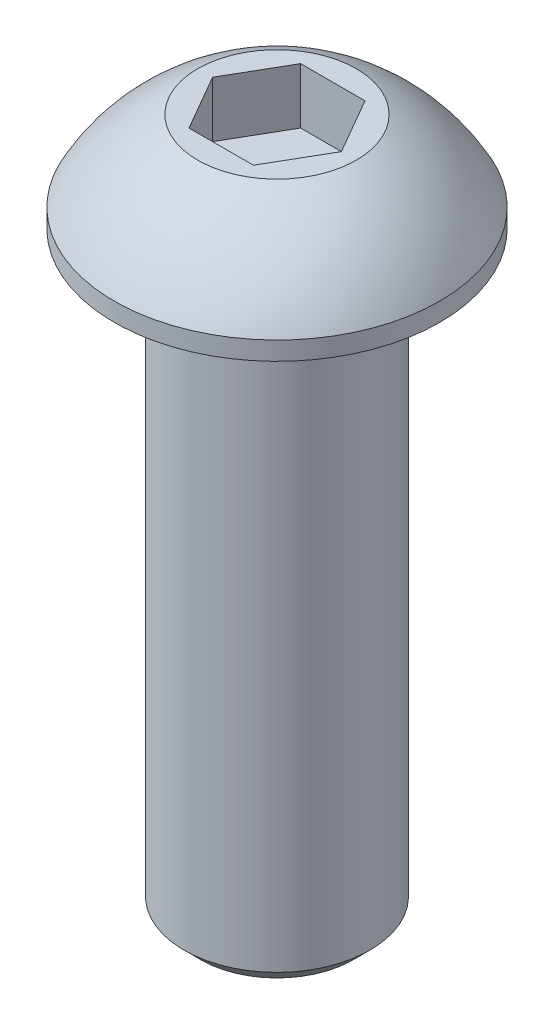
ISO-10303-21;
HEADER;
FILE_DESCRIPTION(('STEP AP214'),'2;1');
FILE_NAME('part.step','',(''),(''),'','','');
FILE_SCHEMA(('AUTOMOTIVE_DESIGN { 1 0 10303 214 1 1 1 1 }'));
ENDSEC;
DATA;
#1=APPLICATION_CONTEXT('core data for automotive mechanical design processes');
#2=APPLICATION_PROTOCOL_DEFINITION('international standard','automotive_design',2000,#1);
#3=PRODUCT_CONTEXT('',#1,'mechanical');
#4=PRODUCT('Part','Part','',(#3));
#5=PRODUCT_RELATED_PRODUCT_CATEGORY('part','',(#4));
#6=PRODUCT_DEFINITION_FORMATION('','',#4);
#7=PRODUCT_DEFINITION_CONTEXT('part definition',#1,'design');
#8=PRODUCT_DEFINITION('design','',#6,#7);
#9=PRODUCT_DEFINITION_SHAPE('','',#8);
#10=(LENGTH_UNIT() NAMED_UNIT(*) SI_UNIT(.MILLI.,.METRE.));
#11=(NAMED_UNIT(*) PLANE_ANGLE_UNIT() SI_UNIT($,.RADIAN.));
#12=(NAMED_UNIT(*) SI_UNIT($,.STERADIAN.) SOLID_ANGLE_UNIT());
#13=UNCERTAINTY_MEASURE_WITH_UNIT(LENGTH_MEASURE(1.E-05),#10,'distance_accuracy_value','');
#14=(GEOMETRIC_REPRESENTATION_CONTEXT(3) GLOBAL_UNCERTAINTY_ASSIGNED_CONTEXT((#13)) GLOBAL_UNIT_ASSIGNED_CONTEXT((#10,
#11,#12)) REPRESENTATION_CONTEXT('',''));
#15=CARTESIAN_POINT('',(0.,0.,0.));
#16=DIRECTION('',(0.,0.,1.));
#17=DIRECTION('',(1.,0.,0.));
#18=AXIS2_PLACEMENT_3D('',#15,#16,#17);
#19=CARTESIAN_POINT('',(0.,-25.4,0.));
#20=DIRECTION('',(0.,1.,0.));
#21=DIRECTION('',(-1.,0.,0.));
#22=AXIS2_PLACEMENT_3D('',#19,#20,#21);
#23=PLANE('',#22);
#24=CARTESIAN_POINT('',(0.,-25.4,0.));
#25=DIRECTION('',(0.,1.,0.));
#26=DIRECTION('',(-1.,0.,0.));
#27=AXIS2_PLACEMENT_3D('',#24,#25,#26);
#28=CIRCLE('',#27,3.26319444444444);
#29=CARTESIAN_POINT('',(-3.26319444444443,-25.4,0.));
#30=VERTEX_POINT('',#29);
#31=EDGE_CURVE('E11',#30,#30,#28,.T.);
#32=ORIENTED_EDGE('',*,*,#31,.F.);
#33=EDGE_LOOP('',(#32));
#34=FACE_BOUND('',#33,.T.);
#35=ADVANCED_FACE('F33',(#34),#23,.F.);
#36=CARTESIAN_POINT('',(0.,-25.4,0.));
#37=DIRECTION('',(0.,1.,0.));
#38=DIRECTION('',(-1.,0.,0.));
#39=AXIS2_PLACEMENT_3D('',#36,#37,#38);
#40=CONICAL_SURFACE('',#39,3.26319444444444,0.785398163397458);
#41=CARTESIAN_POINT('',(0.,-24.6944444444444,0.));
#42=DIRECTION('',(0.,1.,0.));
#43=DIRECTION('',(-1.,0.,0.));
#44=AXIS2_PLACEMENT_3D('',#41,#42,#43);
#45=CIRCLE('',#44,3.96875);
#46=CARTESIAN_POINT('',(-3.96874999999999,-24.6944444444444,0.));
#47=VERTEX_POINT('',#46);
#48=EDGE_CURVE('E40',#47,#47,#45,.T.);
#49=ORIENTED_EDGE('',*,*,#48,.F.);
#50=EDGE_LOOP('',(#49));
#51=FACE_BOUND('',#50,.T.);
#52=ORIENTED_EDGE('',*,*,#31,.T.);
#53=EDGE_LOOP('',(#52));
#54=FACE_BOUND('',#53,.T.);
#55=ADVANCED_FACE('F155',(#51,#54),#40,.T.);
#56=CARTESIAN_POINT('',(0.,69.088,0.));
#57=DIRECTION('',(0.,1.,0.));
#58=DIRECTION('',(-1.,0.,0.));
#59=AXIS2_PLACEMENT_3D('',#56,#57,#58);
#60=CYLINDRICAL_SURFACE('',#59,3.96875);
#61=CARTESIAN_POINT('',(0.,0.,0.));
#62=DIRECTION('',(0.,1.,0.));
#63=DIRECTION('',(-1.,0.,0.));
#64=AXIS2_PLACEMENT_3D('',#61,#62,#63);
#65=CIRCLE('',#64,3.96875);
#66=CARTESIAN_POINT('',(-3.96874999999999,0.,0.));
#67=VERTEX_POINT('',#66);
#68=EDGE_CURVE('E148',#67,#67,#65,.T.);
#69=ORIENTED_EDGE('',*,*,#68,.F.);
#70=EDGE_LOOP('',(#69));
#71=FACE_BOUND('',#70,.T.);
#72=ORIENTED_EDGE('',*,*,#48,.T.);
#73=EDGE_LOOP('',(#72));
#74=FACE_BOUND('',#73,.T.);
#75=ADVANCED_FACE('F153',(#71,#74),#60,.T.);
#76=CARTESIAN_POINT('',(3.96875000000001,0.,0.));
#77=DIRECTION('',(0.,1.,0.));
#78=DIRECTION('',(-1.,0.,0.));
#79=AXIS2_PLACEMENT_3D('',#76,#77,#78);
#80=PLANE('',#79);
#81=CARTESIAN_POINT('',(0.,0.,0.));
#82=DIRECTION('',(0.,1.,0.));
#83=DIRECTION('',(-1.,0.,0.));
#84=AXIS2_PLACEMENT_3D('',#81,#82,#83);
#85=CIRCLE('',#84,6.9469);
#86=CARTESIAN_POINT('',(-6.94689999999999,0.,0.));
#87=VERTEX_POINT('',#86);
#88=EDGE_CURVE('E145',#87,#87,#85,.T.);
#89=ORIENTED_EDGE('',*,*,#88,.F.);
#90=EDGE_LOOP('',(#89));
#91=FACE_BOUND('',#90,.T.);
#92=ORIENTED_EDGE('',*,*,#68,.T.);
#93=EDGE_LOOP('',(#92));
#94=FACE_BOUND('',#93,.T.);
#95=ADVANCED_FACE('F173',(#91,#94),#80,.F.);
#96=CARTESIAN_POINT('',(0.,69.088,0.));
#97=DIRECTION('',(0.,1.,0.));
#98=DIRECTION('',(-1.,0.,0.));
#99=AXIS2_PLACEMENT_3D('',#96,#97,#98);
#100=CYLINDRICAL_SURFACE('',#99,6.9469);
#101=CARTESIAN_POINT('',(0.,0.787399999999994,0.));
#102=DIRECTION('',(0.,1.,0.));
#103=DIRECTION('',(-1.,0.,0.));
#104=AXIS2_PLACEMENT_3D('',#101,#102,#103);
#105=CIRCLE('',#104,6.9469);
#106=CARTESIAN_POINT('',(-6.94689999999999,0.787399999999993,0.));
#107=VERTEX_POINT('',#106);
#108=EDGE_CURVE('E142',#107,#107,#105,.T.);
#109=ORIENTED_EDGE('',*,*,#108,.F.);
#110=EDGE_LOOP('',(#109));
#111=FACE_BOUND('',#110,.T.);
#112=ORIENTED_EDGE('',*,*,#88,.T.);
#113=EDGE_LOOP('',(#112));
#114=FACE_BOUND('',#113,.T.);
#115=ADVANCED_FACE('F181',(#111,#114),#100,.T.);
#116=CARTESIAN_POINT('',(0.,-2.86463469314528,0.));
#117=DIRECTION('',(0.,1.,0.));
#118=DIRECTION('',(1.,0.,0.));
#119=AXIS2_PLACEMENT_3D('',#116,#117,#118);
#120=SPHERICAL_SURFACE('',#119,7.84836142197444);
#121=CARTESIAN_POINT('',(0.,4.21639999999999,0.));
#122=DIRECTION('',(0.,1.,0.));
#123=DIRECTION('',(-1.,0.,0.));
#124=AXIS2_PLACEMENT_3D('',#121,#122,#123);
#125=CIRCLE('',#124,3.38463065701558);
#126=CARTESIAN_POINT('',(-3.38463065701557,4.21639999999999,0.));
#127=VERTEX_POINT('',#126);
#128=EDGE_CURVE('E134',#127,#127,#125,.T.);
#129=ORIENTED_EDGE('',*,*,#128,.F.);
#130=EDGE_LOOP('',(#129));
#131=FACE_BOUND('',#130,.T.);
#132=ORIENTED_EDGE('',*,*,#108,.T.);
#133=EDGE_LOOP('',(#132));
#134=FACE_BOUND('',#133,.T.);
#135=ADVANCED_FACE('F189',(#131,#134),#120,.T.);
#136=CARTESIAN_POINT('',(3.38463065701558,4.2164,0.));
#137=DIRECTION('',(0.,-1.,0.));
#138=DIRECTION('',(1.,0.,0.));
#139=AXIS2_PLACEMENT_3D('',#136,#137,#138);
#140=PLANE('',#139);
#141=DIRECTION('',(-0.5,0.,-0.866025403784439));
#142=VECTOR('',#141,1.);
#143=CARTESIAN_POINT('',(2.74963065701558,4.2164,0.));
#144=LINE('',#143,#142);
#145=CARTESIAN_POINT('',(2.74963065701558,4.2164,0.));
#146=VERTEX_POINT('',#145);
#147=CARTESIAN_POINT('',(1.37481532850779,4.2164,-2.38124999999999));
#148=VERTEX_POINT('',#147);
#149=EDGE_CURVE('E121',#146,#148,#144,.T.);
#150=ORIENTED_EDGE('',*,*,#149,.F.);
#151=DIRECTION('',(0.5,0.,-0.866025403784439));
#152=VECTOR('',#151,1.);
#153=CARTESIAN_POINT('',(1.37481532850779,4.2164,2.38124999999999));
#154=LINE('',#153,#152);
#155=CARTESIAN_POINT('',(1.37481532850779,4.2164,2.38124999999999));
#156=VERTEX_POINT('',#155);
#157=EDGE_CURVE('E47',#156,#146,#154,.T.);
#158=ORIENTED_EDGE('',*,*,#157,.F.);
#159=DIRECTION('',(1.,0.,0.));
#160=VECTOR('',#159,1.);
#161=CARTESIAN_POINT('',(-1.37481532850779,4.2164,2.38124999999999));
#162=LINE('',#161,#160);
#163=CARTESIAN_POINT('',(-1.37481532850779,4.2164,2.38124999999999));
#164=VERTEX_POINT('',#163);
#165=EDGE_CURVE('E130',#164,#156,#162,.T.);
#166=ORIENTED_EDGE('',*,*,#165,.F.);
#167=DIRECTION('',(0.5,0.,0.866025403784439));
#168=VECTOR('',#167,1.);
#169=CARTESIAN_POINT('',(-2.74963065701559,4.2164,0.));
#170=LINE('',#169,#168);
#171=CARTESIAN_POINT('',(-2.74963065701559,4.2164,0.));
#172=VERTEX_POINT('',#171);
#173=EDGE_CURVE('E128',#172,#164,#170,.T.);
#174=ORIENTED_EDGE('',*,*,#173,.F.);
#175=DIRECTION('',(-0.5,0.,0.866025403784439));
#176=VECTOR('',#175,1.);
#177=CARTESIAN_POINT('',(-1.37481532850779,4.2164,-2.38124999999999));
#178=LINE('',#177,#176);
#179=CARTESIAN_POINT('',(-1.37481532850779,4.2164,-2.38124999999999));
#180=VERTEX_POINT('',#179);
#181=EDGE_CURVE('E95',#180,#172,#178,.T.);
#182=ORIENTED_EDGE('',*,*,#181,.F.);
#183=DIRECTION('',(-1.,0.,0.));
#184=VECTOR('',#183,1.);
#185=CARTESIAN_POINT('',(1.37481532850779,4.2164,-2.38124999999999));
#186=LINE('',#185,#184);
#187=EDGE_CURVE('E124',#148,#180,#186,.T.);
#188=ORIENTED_EDGE('',*,*,#187,.F.);
#189=EDGE_LOOP('',(#150,#158,#166,#174,#182,#188));
#190=FACE_BOUND('',#189,.T.);
#191=ORIENTED_EDGE('',*,*,#128,.T.);
#192=EDGE_LOOP('',(#191));
#193=FACE_BOUND('',#192,.T.);
#194=ADVANCED_FACE('F197',(#190,#193),#140,.F.);
#195=CARTESIAN_POINT('',(1.37481532850779,1.83515,2.38124999999999));
#196=DIRECTION('',(0.866025403784439,0.,0.5));
#197=DIRECTION('',(0.5,0.,-0.866025403784439));
#198=AXIS2_PLACEMENT_3D('',#195,#196,#197);
#199=PLANE('',#198);
#200=ORIENTED_EDGE('',*,*,#157,.T.);
#201=DIRECTION('',(0.,1.,0.));
#202=VECTOR('',#201,1.);
#203=CARTESIAN_POINT('',(2.74963065701558,1.83515,0.));
#204=LINE('',#203,#202);
#205=CARTESIAN_POINT('',(2.74963065701558,1.83515,0.));
#206=VERTEX_POINT('',#205);
#207=EDGE_CURVE('E77',#206,#146,#204,.T.);
#208=ORIENTED_EDGE('',*,*,#207,.F.);
#209=DIRECTION('',(0.5,0.,-0.866025403784439));
#210=VECTOR('',#209,1.);
#211=CARTESIAN_POINT('',(1.37481532850779,1.83515,2.38124999999999));
#212=LINE('',#211,#210);
#213=CARTESIAN_POINT('',(1.37481532850779,1.83515,2.38124999999999));
#214=VERTEX_POINT('',#213);
#215=EDGE_CURVE('E132',#214,#206,#212,.T.);
#216=ORIENTED_EDGE('',*,*,#215,.F.);
#217=DIRECTION('',(0.,1.,0.));
#218=VECTOR('',#217,1.);
#219=CARTESIAN_POINT('',(1.37481532850779,1.83515,2.38124999999999));
#220=LINE('',#219,#218);
#221=EDGE_CURVE('E55',#214,#156,#220,.T.);
#222=ORIENTED_EDGE('',*,*,#221,.T.);
#223=EDGE_LOOP('',(#200,#208,#216,#222));
#224=FACE_BOUND('',#223,.T.);
#225=ADVANCED_FACE('F205',(#224),#199,.F.);
#226=CARTESIAN_POINT('',(-1.37481532850779,1.83515,2.38124999999999));
#227=DIRECTION('',(0.,0.,1.));
#228=DIRECTION('',(1.,0.,0.));
#229=AXIS2_PLACEMENT_3D('',#226,#227,#228);
#230=PLANE('',#229);
#231=ORIENTED_EDGE('',*,*,#165,.T.);
#232=ORIENTED_EDGE('',*,*,#221,.F.);
#233=DIRECTION('',(1.,0.,0.));
#234=VECTOR('',#233,1.);
#235=CARTESIAN_POINT('',(-1.37481532850779,1.83515,2.38124999999999));
#236=LINE('',#235,#234);
#237=CARTESIAN_POINT('',(-1.37481532850779,1.83515,2.38124999999999));
#238=VERTEX_POINT('',#237);
#239=EDGE_CURVE('E107',#238,#214,#236,.T.);
#240=ORIENTED_EDGE('',*,*,#239,.F.);
#241=DIRECTION('',(0.,1.,0.));
#242=VECTOR('',#241,1.);
#243=CARTESIAN_POINT('',(-1.37481532850779,1.83515,2.38124999999999));
#244=LINE('',#243,#242);
#245=EDGE_CURVE('E99',#238,#164,#244,.T.);
#246=ORIENTED_EDGE('',*,*,#245,.T.);
#247=EDGE_LOOP('',(#231,#232,#240,#246));
#248=FACE_BOUND('',#247,.T.);
#249=ADVANCED_FACE('F213',(#248),#230,.F.);
#250=CARTESIAN_POINT('',(-2.74963065701559,1.83515,0.));
#251=DIRECTION('',(-0.866025403784439,0.,0.5));
#252=DIRECTION('',(0.5,0.,0.866025403784439));
#253=AXIS2_PLACEMENT_3D('',#250,#251,#252);
#254=PLANE('',#253);
#255=ORIENTED_EDGE('',*,*,#173,.T.);
#256=ORIENTED_EDGE('',*,*,#245,.F.);
#257=DIRECTION('',(0.5,0.,0.866025403784439));
#258=VECTOR('',#257,1.);
#259=CARTESIAN_POINT('',(-2.74963065701559,1.83515,0.));
#260=LINE('',#259,#258);
#261=CARTESIAN_POINT('',(-2.74963065701559,1.83515,0.));
#262=VERTEX_POINT('',#261);
#263=EDGE_CURVE('E103',#262,#238,#260,.T.);
#264=ORIENTED_EDGE('',*,*,#263,.F.);
#265=DIRECTION('',(0.,1.,0.));
#266=VECTOR('',#265,1.);
#267=CARTESIAN_POINT('',(-2.74963065701559,1.83515,0.));
#268=LINE('',#267,#266);
#269=EDGE_CURVE('E88',#262,#172,#268,.T.);
#270=ORIENTED_EDGE('',*,*,#269,.T.);
#271=EDGE_LOOP('',(#255,#256,#264,#270));
#272=FACE_BOUND('',#271,.T.);
#273=ADVANCED_FACE('F104',(#272),#254,.F.);
#274=CARTESIAN_POINT('',(-1.37481532850779,1.83515,-2.38124999999999));
#275=DIRECTION('',(-0.866025403784439,0.,-0.5));
#276=DIRECTION('',(-0.5,0.,0.866025403784438));
#277=AXIS2_PLACEMENT_3D('',#274,#275,#276);
#278=PLANE('',#277);
#279=ORIENTED_EDGE('',*,*,#181,.T.);
#280=ORIENTED_EDGE('',*,*,#269,.F.);
#281=DIRECTION('',(-0.5,0.,0.866025403784439));
#282=VECTOR('',#281,1.);
#283=CARTESIAN_POINT('',(-1.37481532850779,1.83515,-2.38124999999999));
#284=LINE('',#283,#282);
#285=CARTESIAN_POINT('',(-1.37481532850779,1.83515,-2.38124999999999));
#286=VERTEX_POINT('',#285);
#287=EDGE_CURVE('E92',#286,#262,#284,.T.);
#288=ORIENTED_EDGE('',*,*,#287,.F.);
#289=DIRECTION('',(0.,1.,0.));
#290=VECTOR('',#289,1.);
#291=CARTESIAN_POINT('',(-1.37481532850779,1.83515,-2.38124999999999));
#292=LINE('',#291,#290);
#293=EDGE_CURVE('E100',#286,#180,#292,.T.);
#294=ORIENTED_EDGE('',*,*,#293,.T.);
#295=EDGE_LOOP('',(#279,#280,#288,#294));
#296=FACE_BOUND('',#295,.T.);
#297=ADVANCED_FACE('F90',(#296),#278,.F.);
#298=CARTESIAN_POINT('',(1.37481532850779,1.83515,-2.38124999999999));
#299=DIRECTION('',(0.,0.,-1.));
#300=DIRECTION('',(-1.,0.,0.));
#301=AXIS2_PLACEMENT_3D('',#298,#299,#300);
#302=PLANE('',#301);
#303=ORIENTED_EDGE('',*,*,#187,.T.);
#304=ORIENTED_EDGE('',*,*,#293,.F.);
#305=DIRECTION('',(-1.,0.,0.));
#306=VECTOR('',#305,1.);
#307=CARTESIAN_POINT('',(1.37481532850779,1.83515,-2.38124999999999));
#308=LINE('',#307,#306);
#309=CARTESIAN_POINT('',(1.37481532850779,1.83515,-2.38124999999999));
#310=VERTEX_POINT('',#309);
#311=EDGE_CURVE('E113',#310,#286,#308,.T.);
#312=ORIENTED_EDGE('',*,*,#311,.F.);
#313=DIRECTION('',(0.,1.,0.));
#314=VECTOR('',#313,1.);
#315=CARTESIAN_POINT('',(1.37481532850779,1.83515,-2.38124999999999));
#316=LINE('',#315,#314);
#317=EDGE_CURVE('E137',#310,#148,#316,.T.);
#318=ORIENTED_EDGE('',*,*,#317,.T.);
#319=EDGE_LOOP('',(#303,#304,#312,#318));
#320=FACE_BOUND('',#319,.T.);
#321=ADVANCED_FACE('F232',(#320),#302,.F.);
#322=CARTESIAN_POINT('',(2.74963065701558,1.83515,0.));
#323=DIRECTION('',(0.866025403784439,0.,-0.5));
#324=DIRECTION('',(-0.5,0.,-0.866025403784439));
#325=AXIS2_PLACEMENT_3D('',#322,#323,#324);
#326=PLANE('',#325);
#327=ORIENTED_EDGE('',*,*,#149,.T.);
#328=ORIENTED_EDGE('',*,*,#317,.F.);
#329=DIRECTION('',(-0.5,0.,-0.866025403784439));
#330=VECTOR('',#329,1.);
#331=CARTESIAN_POINT('',(2.74963065701558,1.83515,0.));
#332=LINE('',#331,#330);
#333=EDGE_CURVE('E115',#206,#310,#332,.T.);
#334=ORIENTED_EDGE('',*,*,#333,.F.);
#335=ORIENTED_EDGE('',*,*,#207,.T.);
#336=EDGE_LOOP('',(#327,#328,#334,#335));
#337=FACE_BOUND('',#336,.T.);
#338=ADVANCED_FACE('F239',(#337),#326,.F.);
#339=CARTESIAN_POINT('',(4.12444598552338,1.83515,-2.38124999999999));
#340=DIRECTION('',(0.,1.,0.));
#341=DIRECTION('',(0.,0.,1.));
#342=AXIS2_PLACEMENT_3D('',#339,#340,#341);
#343=PLANE('',#342);
#344=ORIENTED_EDGE('',*,*,#215,.T.);
#345=ORIENTED_EDGE('',*,*,#333,.T.);
#346=ORIENTED_EDGE('',*,*,#311,.T.);
#347=ORIENTED_EDGE('',*,*,#287,.T.);
#348=ORIENTED_EDGE('',*,*,#263,.T.);
#349=ORIENTED_EDGE('',*,*,#239,.T.);
#350=EDGE_LOOP('',(#344,#345,#346,#347,#348,#349));
#351=FACE_BOUND('',#350,.T.);
#352=ADVANCED_FACE('F110',(#351),#343,.T.);
#353=CLOSED_SHELL('',(#35,#55,#75,#95,#115,#135,#194,#225,#249,#273,#297,#321,#338,#352));
#354=MANIFOLD_SOLID_BREP('B2',#353);
#355=ADVANCED_BREP_SHAPE_REPRESENTATION('',(#18,#354),#14);
#356=SHAPE_DEFINITION_REPRESENTATION(#9,#355);
ENDSEC;
END-ISO-10303-21;
